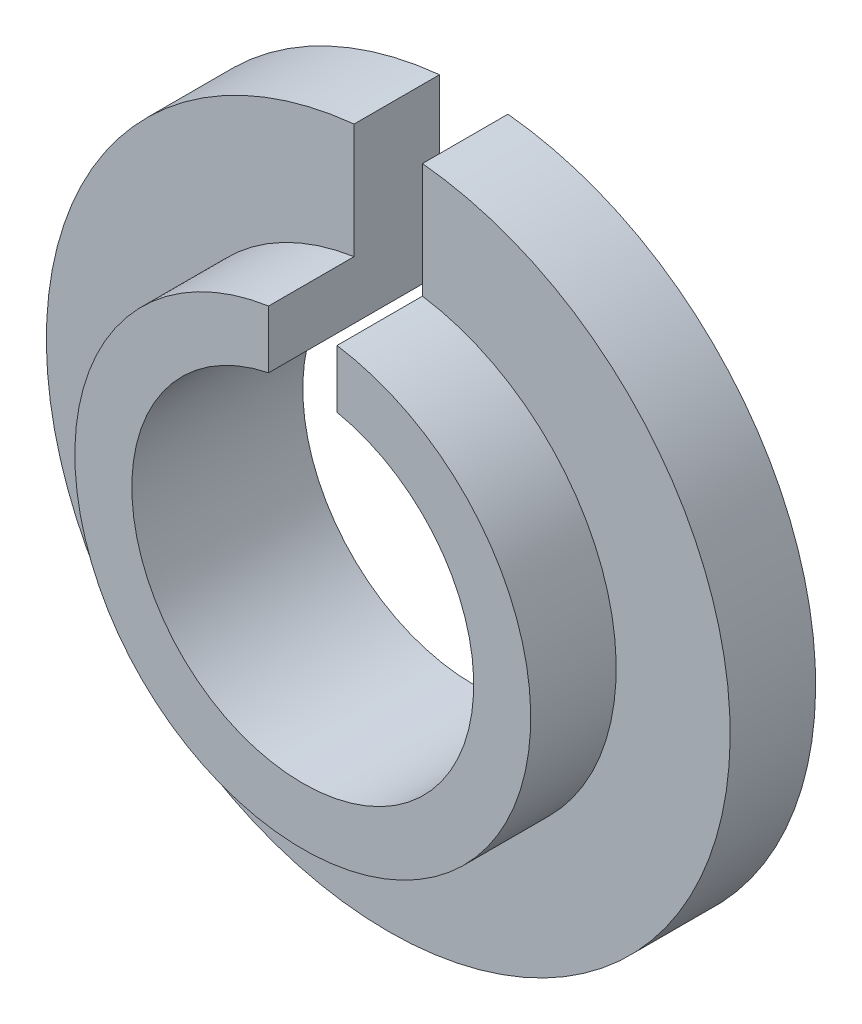
ISO-10303-21;
HEADER;
FILE_DESCRIPTION(('STEP AP214'),'2;1');
FILE_NAME('part.step','',(''),(''),'','','');
FILE_SCHEMA(('AUTOMOTIVE_DESIGN { 1 0 10303 214 1 1 1 1 }'));
ENDSEC;
DATA;
#1=APPLICATION_CONTEXT('core data for automotive mechanical design processes');
#2=APPLICATION_PROTOCOL_DEFINITION('international standard','automotive_design',2000,#1);
#3=PRODUCT_CONTEXT('',#1,'mechanical');
#4=PRODUCT('Part','Part','',(#3));
#5=PRODUCT_RELATED_PRODUCT_CATEGORY('part','',(#4));
#6=PRODUCT_DEFINITION_FORMATION('','',#4);
#7=PRODUCT_DEFINITION_CONTEXT('part definition',#1,'design');
#8=PRODUCT_DEFINITION('design','',#6,#7);
#9=PRODUCT_DEFINITION_SHAPE('','',#8);
#10=(LENGTH_UNIT() NAMED_UNIT(*) SI_UNIT(.MILLI.,.METRE.));
#11=(NAMED_UNIT(*) PLANE_ANGLE_UNIT() SI_UNIT($,.RADIAN.));
#12=(NAMED_UNIT(*) SI_UNIT($,.STERADIAN.) SOLID_ANGLE_UNIT());
#13=UNCERTAINTY_MEASURE_WITH_UNIT(LENGTH_MEASURE(1.E-05),#10,'distance_accuracy_value','');
#14=(GEOMETRIC_REPRESENTATION_CONTEXT(3) GLOBAL_UNCERTAINTY_ASSIGNED_CONTEXT((#13)) GLOBAL_UNIT_ASSIGNED_CONTEXT((#10,
#11,#12)) REPRESENTATION_CONTEXT('',''));
#15=CARTESIAN_POINT('',(0.,0.,0.));
#16=DIRECTION('',(0.,0.,1.));
#17=DIRECTION('',(1.,0.,0.));
#18=AXIS2_PLACEMENT_3D('',#15,#16,#17);
#19=CARTESIAN_POINT('',(0.,0.,15.));
#20=DIRECTION('',(0.,0.,-1.));
#21=DIRECTION('',(-1.,0.,0.));
#22=AXIS2_PLACEMENT_3D('',#19,#20,#21);
#23=CYLINDRICAL_SURFACE('',#22,20.);
#24=DIRECTION('',(0.,0.,-1.));
#25=VECTOR('',#24,1.);
#26=CARTESIAN_POINT('',(-3.,19.7737199332852,15.));
#27=LINE('',#26,#25);
#28=CARTESIAN_POINT('',(-3.,19.7737199332852,7.5));
#29=VERTEX_POINT('',#28);
#30=CARTESIAN_POINT('',(-3.,19.7737199332852,15.));
#31=VERTEX_POINT('',#30);
#32=EDGE_CURVE('E130',#29,#31,#27,.F.);
#33=ORIENTED_EDGE('',*,*,#32,.F.);
#34=CARTESIAN_POINT('',(0.,0.,7.5));
#35=DIRECTION('',(0.,0.,-1.));
#36=DIRECTION('',(-1.,0.,0.));
#37=AXIS2_PLACEMENT_3D('',#34,#35,#36);
#38=CIRCLE('',#37,20.);
#39=CARTESIAN_POINT('',(3.,19.7737199332852,7.5));
#40=VERTEX_POINT('',#39);
#41=EDGE_CURVE('E118',#40,#29,#38,.T.);
#42=ORIENTED_EDGE('',*,*,#41,.F.);
#43=DIRECTION('',(0.,0.,-1.));
#44=VECTOR('',#43,1.);
#45=CARTESIAN_POINT('',(3.,19.7737199332852,15.));
#46=LINE('',#45,#44);
#47=CARTESIAN_POINT('',(3.,19.7737199332852,15.));
#48=VERTEX_POINT('',#47);
#49=EDGE_CURVE('E54',#48,#40,#46,.T.);
#50=ORIENTED_EDGE('',*,*,#49,.F.);
#51=CARTESIAN_POINT('',(0.,0.,15.));
#52=DIRECTION('',(0.,0.,1.));
#53=DIRECTION('',(1.,0.,0.));
#54=AXIS2_PLACEMENT_3D('',#51,#52,#53);
#55=CIRCLE('',#54,20.);
#56=EDGE_CURVE('E109',#31,#48,#55,.T.);
#57=ORIENTED_EDGE('',*,*,#56,.F.);
#58=EDGE_LOOP('',(#33,#42,#50,#57));
#59=FACE_BOUND('',#58,.T.);
#60=ADVANCED_FACE('F33',(#59),#23,.T.);
#61=CARTESIAN_POINT('',(0.,0.,15.));
#62=DIRECTION('',(0.,0.,1.));
#63=DIRECTION('',(1.,0.,0.));
#64=AXIS2_PLACEMENT_3D('',#61,#62,#63);
#65=PLANE('',#64);
#66=CARTESIAN_POINT('',(0.,0.,15.));
#67=DIRECTION('',(0.,0.,1.));
#68=DIRECTION('',(1.,0.,0.));
#69=AXIS2_PLACEMENT_3D('',#66,#67,#68);
#70=CIRCLE('',#69,15.);
#71=CARTESIAN_POINT('',(-3.,14.6969384566991,15.));
#72=VERTEX_POINT('',#71);
#73=CARTESIAN_POINT('',(3.,14.6969384566991,15.));
#74=VERTEX_POINT('',#73);
#75=EDGE_CURVE('E103',#72,#74,#70,.T.);
#76=ORIENTED_EDGE('',*,*,#75,.F.);
#77=DIRECTION('',(0.,-1.,0.));
#78=VECTOR('',#77,1.);
#79=CARTESIAN_POINT('',(-3.,0.,15.));
#80=LINE('',#79,#78);
#81=EDGE_CURVE('E93',#31,#72,#80,.T.);
#82=ORIENTED_EDGE('',*,*,#81,.F.);
#83=ORIENTED_EDGE('',*,*,#56,.T.);
#84=DIRECTION('',(0.,1.,0.));
#85=VECTOR('',#84,1.);
#86=CARTESIAN_POINT('',(3.,0.,15.));
#87=LINE('',#86,#85);
#88=EDGE_CURVE('E125',#74,#48,#87,.T.);
#89=ORIENTED_EDGE('',*,*,#88,.F.);
#90=EDGE_LOOP('',(#76,#82,#83,#89));
#91=FACE_BOUND('',#90,.T.);
#92=ADVANCED_FACE('F143',(#91),#65,.T.);
#93=CARTESIAN_POINT('',(0.,0.,0.));
#94=DIRECTION('',(0.,0.,1.));
#95=DIRECTION('',(1.,0.,0.));
#96=AXIS2_PLACEMENT_3D('',#93,#94,#95);
#97=PLANE('',#96);
#98=DIRECTION('',(0.,-1.,0.));
#99=VECTOR('',#98,1.);
#100=CARTESIAN_POINT('',(-3.,0.,0.));
#101=LINE('',#100,#99);
#102=CARTESIAN_POINT('',(-3.,29.8496231131986,0.));
#103=VERTEX_POINT('',#102);
#104=CARTESIAN_POINT('',(-3.,14.6969384566991,0.));
#105=VERTEX_POINT('',#104);
#106=EDGE_CURVE('E94',#103,#105,#101,.T.);
#107=ORIENTED_EDGE('',*,*,#106,.T.);
#108=CARTESIAN_POINT('',(0.,0.,0.));
#109=DIRECTION('',(0.,0.,1.));
#110=DIRECTION('',(1.,0.,0.));
#111=AXIS2_PLACEMENT_3D('',#108,#109,#110);
#112=CIRCLE('',#111,15.);
#113=CARTESIAN_POINT('',(3.,14.6969384566991,0.));
#114=VERTEX_POINT('',#113);
#115=EDGE_CURVE('E101',#105,#114,#112,.T.);
#116=ORIENTED_EDGE('',*,*,#115,.T.);
#117=DIRECTION('',(0.,1.,0.));
#118=VECTOR('',#117,1.);
#119=CARTESIAN_POINT('',(3.,0.,0.));
#120=LINE('',#119,#118);
#121=CARTESIAN_POINT('',(3.,29.8496231131986,0.));
#122=VERTEX_POINT('',#121);
#123=EDGE_CURVE('E82',#114,#122,#120,.T.);
#124=ORIENTED_EDGE('',*,*,#123,.T.);
#125=CARTESIAN_POINT('',(0.,0.,0.));
#126=DIRECTION('',(0.,0.,-1.));
#127=DIRECTION('',(-1.,0.,0.));
#128=AXIS2_PLACEMENT_3D('',#125,#126,#127);
#129=CIRCLE('',#128,30.);
#130=EDGE_CURVE('E112',#122,#103,#129,.T.);
#131=ORIENTED_EDGE('',*,*,#130,.T.);
#132=EDGE_LOOP('',(#107,#116,#124,#131));
#133=FACE_BOUND('',#132,.T.);
#134=ADVANCED_FACE('F106',(#133),#97,.F.);
#135=CARTESIAN_POINT('',(0.,0.,15.));
#136=DIRECTION('',(0.,0.,-1.));
#137=DIRECTION('',(-1.,0.,0.));
#138=AXIS2_PLACEMENT_3D('',#135,#136,#137);
#139=CYLINDRICAL_SURFACE('',#138,15.);
#140=ORIENTED_EDGE('',*,*,#115,.F.);
#141=DIRECTION('',(0.,0.,-1.));
#142=VECTOR('',#141,1.);
#143=CARTESIAN_POINT('',(-3.,14.6969384566991,15.));
#144=LINE('',#143,#142);
#145=EDGE_CURVE('E134',#105,#72,#144,.F.);
#146=ORIENTED_EDGE('',*,*,#145,.T.);
#147=ORIENTED_EDGE('',*,*,#75,.T.);
#148=DIRECTION('',(0.,0.,-1.));
#149=VECTOR('',#148,1.);
#150=CARTESIAN_POINT('',(3.,14.6969384566991,15.));
#151=LINE('',#150,#149);
#152=EDGE_CURVE('E85',#74,#114,#151,.T.);
#153=ORIENTED_EDGE('',*,*,#152,.T.);
#154=EDGE_LOOP('',(#140,#146,#147,#153));
#155=FACE_BOUND('',#154,.T.);
#156=ADVANCED_FACE('F99',(#155),#139,.F.);
#157=CARTESIAN_POINT('',(0.,0.,7.5));
#158=DIRECTION('',(0.,0.,-1.));
#159=DIRECTION('',(-1.,0.,0.));
#160=AXIS2_PLACEMENT_3D('',#157,#158,#159);
#161=CYLINDRICAL_SURFACE('',#160,30.);
#162=CARTESIAN_POINT('',(0.,0.,7.5));
#163=DIRECTION('',(0.,0.,-1.));
#164=DIRECTION('',(-1.,0.,0.));
#165=AXIS2_PLACEMENT_3D('',#162,#163,#164);
#166=CIRCLE('',#165,30.);
#167=CARTESIAN_POINT('',(3.,29.8496231131986,7.5));
#168=VERTEX_POINT('',#167);
#169=CARTESIAN_POINT('',(-3.,29.8496231131986,7.5));
#170=VERTEX_POINT('',#169);
#171=EDGE_CURVE('E107',#168,#170,#166,.T.);
#172=ORIENTED_EDGE('',*,*,#171,.T.);
#173=DIRECTION('',(0.,0.,-1.));
#174=VECTOR('',#173,1.);
#175=CARTESIAN_POINT('',(-3.,29.8496231131986,7.5));
#176=LINE('',#175,#174);
#177=EDGE_CURVE('E46',#170,#103,#176,.T.);
#178=ORIENTED_EDGE('',*,*,#177,.T.);
#179=ORIENTED_EDGE('',*,*,#130,.F.);
#180=DIRECTION('',(0.,0.,-1.));
#181=VECTOR('',#180,1.);
#182=CARTESIAN_POINT('',(3.,29.8496231131986,7.5));
#183=LINE('',#182,#181);
#184=EDGE_CURVE('E88',#122,#168,#183,.F.);
#185=ORIENTED_EDGE('',*,*,#184,.T.);
#186=EDGE_LOOP('',(#172,#178,#179,#185));
#187=FACE_BOUND('',#186,.T.);
#188=ADVANCED_FACE('F124',(#187),#161,.T.);
#189=CARTESIAN_POINT('',(0.,0.,7.5));
#190=DIRECTION('',(0.,0.,-1.));
#191=DIRECTION('',(-1.,0.,0.));
#192=AXIS2_PLACEMENT_3D('',#189,#190,#191);
#193=PLANE('',#192);
#194=DIRECTION('',(0.,-1.,0.));
#195=VECTOR('',#194,1.);
#196=CARTESIAN_POINT('',(-3.,0.,7.5));
#197=LINE('',#196,#195);
#198=EDGE_CURVE('E11',#170,#29,#197,.T.);
#199=ORIENTED_EDGE('',*,*,#198,.F.);
#200=ORIENTED_EDGE('',*,*,#171,.F.);
#201=DIRECTION('',(0.,1.,0.));
#202=VECTOR('',#201,1.);
#203=CARTESIAN_POINT('',(3.,0.,7.5));
#204=LINE('',#203,#202);
#205=EDGE_CURVE('E40',#40,#168,#204,.T.);
#206=ORIENTED_EDGE('',*,*,#205,.F.);
#207=ORIENTED_EDGE('',*,*,#41,.T.);
#208=EDGE_LOOP('',(#199,#200,#206,#207));
#209=FACE_BOUND('',#208,.T.);
#210=ADVANCED_FACE('F127',(#209),#193,.F.);
#211=CARTESIAN_POINT('',(3.,0.,15.));
#212=DIRECTION('',(-1.,0.,0.));
#213=DIRECTION('',(0.,0.,1.));
#214=AXIS2_PLACEMENT_3D('',#211,#212,#213);
#215=PLANE('',#214);
#216=ORIENTED_EDGE('',*,*,#88,.T.);
#217=ORIENTED_EDGE('',*,*,#49,.T.);
#218=ORIENTED_EDGE('',*,*,#205,.T.);
#219=ORIENTED_EDGE('',*,*,#184,.F.);
#220=ORIENTED_EDGE('',*,*,#123,.F.);
#221=ORIENTED_EDGE('',*,*,#152,.F.);
#222=EDGE_LOOP('',(#216,#217,#218,#219,#220,#221));
#223=FACE_BOUND('',#222,.T.);
#224=ADVANCED_FACE('F84',(#223),#215,.T.);
#225=CARTESIAN_POINT('',(-3.,0.,15.));
#226=DIRECTION('',(1.,0.,0.));
#227=DIRECTION('',(0.,0.,-1.));
#228=AXIS2_PLACEMENT_3D('',#225,#226,#227);
#229=PLANE('',#228);
#230=ORIENTED_EDGE('',*,*,#106,.F.);
#231=ORIENTED_EDGE('',*,*,#177,.F.);
#232=ORIENTED_EDGE('',*,*,#198,.T.);
#233=ORIENTED_EDGE('',*,*,#32,.T.);
#234=ORIENTED_EDGE('',*,*,#81,.T.);
#235=ORIENTED_EDGE('',*,*,#145,.F.);
#236=EDGE_LOOP('',(#230,#231,#232,#233,#234,#235));
#237=FACE_BOUND('',#236,.T.);
#238=ADVANCED_FACE('F129',(#237),#229,.T.);
#239=CLOSED_SHELL('',(#60,#92,#134,#156,#188,#210,#224,#238));
#240=MANIFOLD_SOLID_BREP('B2',#239);
#241=ADVANCED_BREP_SHAPE_REPRESENTATION('',(#18,#240),#14);
#242=SHAPE_DEFINITION_REPRESENTATION(#9,#241);
ENDSEC;
END-ISO-10303-21;
